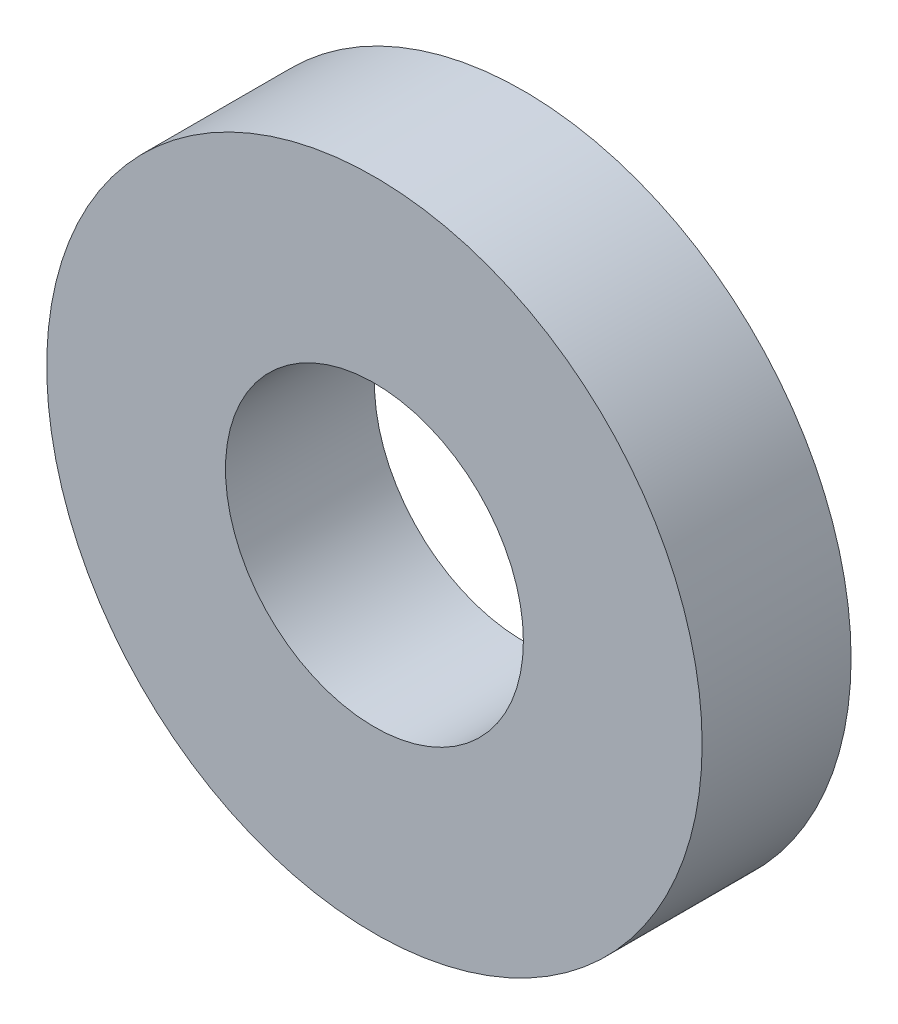
ISO-10303-21;
HEADER;
FILE_DESCRIPTION(('STEP AP214'),'2;1');
FILE_NAME('part.step','',(''),(''),'','','');
FILE_SCHEMA(('AUTOMOTIVE_DESIGN { 1 0 10303 214 1 1 1 1 }'));
ENDSEC;
DATA;
#1=APPLICATION_CONTEXT('core data for automotive mechanical design processes');
#2=APPLICATION_PROTOCOL_DEFINITION('international standard','automotive_design',2000,#1);
#3=PRODUCT_CONTEXT('',#1,'mechanical');
#4=PRODUCT('Part','Part','',(#3));
#5=PRODUCT_RELATED_PRODUCT_CATEGORY('part','',(#4));
#6=PRODUCT_DEFINITION_FORMATION('','',#4);
#7=PRODUCT_DEFINITION_CONTEXT('part definition',#1,'design');
#8=PRODUCT_DEFINITION('design','',#6,#7);
#9=PRODUCT_DEFINITION_SHAPE('','',#8);
#10=(LENGTH_UNIT() NAMED_UNIT(*) SI_UNIT(.MILLI.,.METRE.));
#11=(NAMED_UNIT(*) PLANE_ANGLE_UNIT() SI_UNIT($,.RADIAN.));
#12=(NAMED_UNIT(*) SI_UNIT($,.STERADIAN.) SOLID_ANGLE_UNIT());
#13=UNCERTAINTY_MEASURE_WITH_UNIT(LENGTH_MEASURE(1.E-05),#10,'distance_accuracy_value','');
#14=(GEOMETRIC_REPRESENTATION_CONTEXT(3) GLOBAL_UNCERTAINTY_ASSIGNED_CONTEXT((#13)) GLOBAL_UNIT_ASSIGNED_CONTEXT((#10,
#11,#12)) REPRESENTATION_CONTEXT('',''));
#15=CARTESIAN_POINT('',(0.,0.,0.));
#16=DIRECTION('',(0.,0.,1.));
#17=DIRECTION('',(1.,0.,0.));
#18=AXIS2_PLACEMENT_3D('',#15,#16,#17);
#19=CARTESIAN_POINT('',(0.,0.,6.));
#20=DIRECTION('',(0.,0.,1.));
#21=DIRECTION('',(1.,0.,0.));
#22=AXIS2_PLACEMENT_3D('',#19,#20,#21);
#23=PLANE('',#22);
#24=CARTESIAN_POINT('',(0.,0.,6.));
#25=DIRECTION('',(0.,0.,1.));
#26=DIRECTION('',(1.,0.,0.));
#27=AXIS2_PLACEMENT_3D('',#24,#25,#26);
#28=CIRCLE('',#27,6.);
#29=CARTESIAN_POINT('',(6.,0.,6.));
#30=VERTEX_POINT('',#29);
#31=EDGE_CURVE('E46',#30,#30,#28,.T.);
#32=ORIENTED_EDGE('',*,*,#31,.F.);
#33=EDGE_LOOP('',(#32));
#34=FACE_BOUND('',#33,.T.);
#35=CARTESIAN_POINT('',(0.,0.,6.));
#36=DIRECTION('',(0.,0.,1.));
#37=DIRECTION('',(1.,0.,0.));
#38=AXIS2_PLACEMENT_3D('',#35,#36,#37);
#39=CIRCLE('',#38,13.2);
#40=CARTESIAN_POINT('',(13.2,0.,6.));
#41=VERTEX_POINT('',#40);
#42=EDGE_CURVE('E10',#41,#41,#39,.T.);
#43=ORIENTED_EDGE('',*,*,#42,.T.);
#44=EDGE_LOOP('',(#43));
#45=FACE_BOUND('',#44,.T.);
#46=ADVANCED_FACE('F35',(#34,#45),#23,.T.);
#47=CARTESIAN_POINT('',(0.,0.,0.));
#48=DIRECTION('',(0.,0.,1.));
#49=DIRECTION('',(1.,0.,0.));
#50=AXIS2_PLACEMENT_3D('',#47,#48,#49);
#51=PLANE('',#50);
#52=CARTESIAN_POINT('',(0.,0.,0.));
#53=DIRECTION('',(0.,0.,1.));
#54=DIRECTION('',(1.,0.,0.));
#55=AXIS2_PLACEMENT_3D('',#52,#53,#54);
#56=CIRCLE('',#55,13.2);
#57=CARTESIAN_POINT('',(13.2,0.,0.));
#58=VERTEX_POINT('',#57);
#59=EDGE_CURVE('E39',#58,#58,#56,.T.);
#60=ORIENTED_EDGE('',*,*,#59,.F.);
#61=EDGE_LOOP('',(#60));
#62=FACE_BOUND('',#61,.T.);
#63=CARTESIAN_POINT('',(0.,0.,0.));
#64=DIRECTION('',(0.,0.,1.));
#65=DIRECTION('',(1.,0.,0.));
#66=AXIS2_PLACEMENT_3D('',#63,#64,#65);
#67=CIRCLE('',#66,6.);
#68=CARTESIAN_POINT('',(6.,0.,0.));
#69=VERTEX_POINT('',#68);
#70=EDGE_CURVE('E48',#69,#69,#67,.T.);
#71=ORIENTED_EDGE('',*,*,#70,.T.);
#72=EDGE_LOOP('',(#71));
#73=FACE_BOUND('',#72,.T.);
#74=ADVANCED_FACE('F58',(#62,#73),#51,.F.);
#75=CARTESIAN_POINT('',(0.,0.,6.));
#76=DIRECTION('',(0.,0.,-1.));
#77=DIRECTION('',(-1.,0.,0.));
#78=AXIS2_PLACEMENT_3D('',#75,#76,#77);
#79=CYLINDRICAL_SURFACE('',#78,13.2);
#80=ORIENTED_EDGE('',*,*,#42,.F.);
#81=EDGE_LOOP('',(#80));
#82=FACE_BOUND('',#81,.T.);
#83=ORIENTED_EDGE('',*,*,#59,.T.);
#84=EDGE_LOOP('',(#83));
#85=FACE_BOUND('',#84,.T.);
#86=ADVANCED_FACE('F37',(#82,#85),#79,.T.);
#87=CARTESIAN_POINT('',(0.,0.,6.));
#88=DIRECTION('',(0.,0.,-1.));
#89=DIRECTION('',(-1.,0.,0.));
#90=AXIS2_PLACEMENT_3D('',#87,#88,#89);
#91=CYLINDRICAL_SURFACE('',#90,6.);
#92=ORIENTED_EDGE('',*,*,#31,.T.);
#93=EDGE_LOOP('',(#92));
#94=FACE_BOUND('',#93,.T.);
#95=ORIENTED_EDGE('',*,*,#70,.F.);
#96=EDGE_LOOP('',(#95));
#97=FACE_BOUND('',#96,.T.);
#98=ADVANCED_FACE('F54',(#94,#97),#91,.F.);
#99=CLOSED_SHELL('',(#46,#74,#86,#98));
#100=MANIFOLD_SOLID_BREP('B2',#99);
#101=ADVANCED_BREP_SHAPE_REPRESENTATION('',(#18,#100),#14);
#102=SHAPE_DEFINITION_REPRESENTATION(#9,#101);
ENDSEC;
END-ISO-10303-21;
